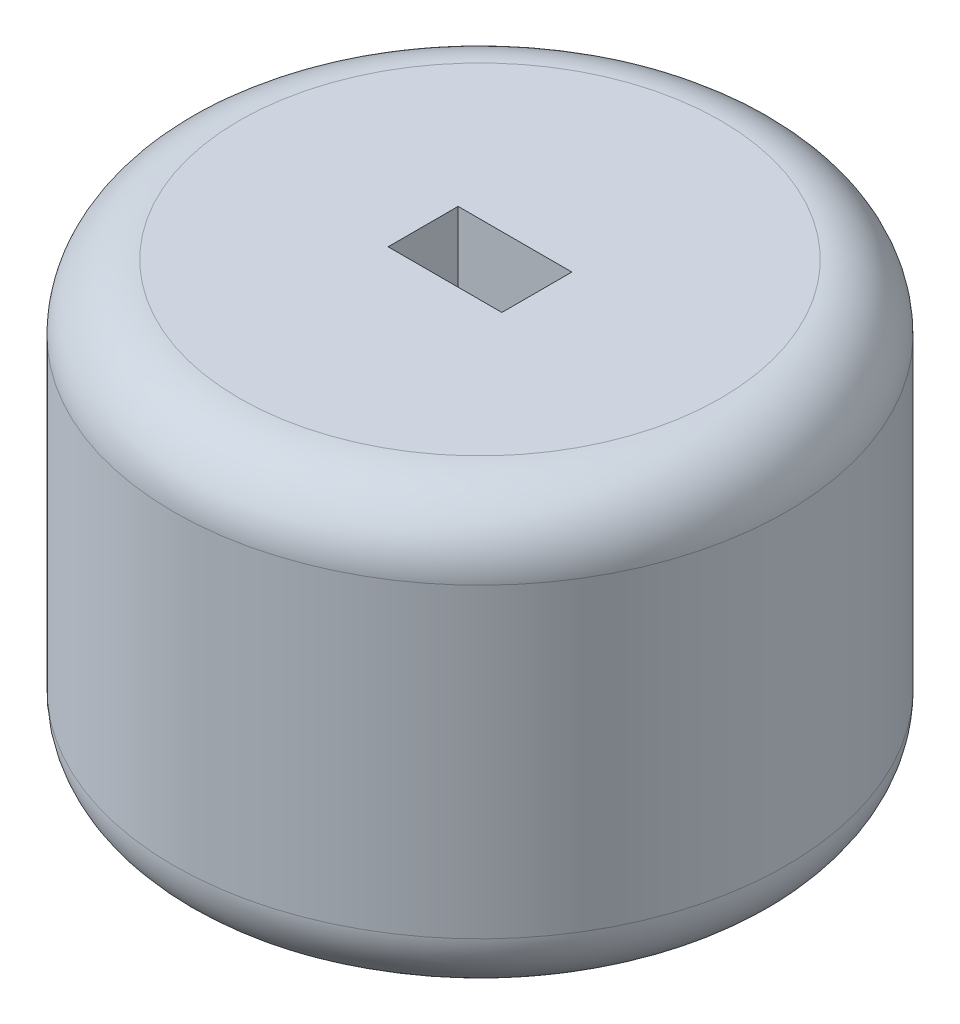
ISO-10303-21;
HEADER;
FILE_DESCRIPTION(('STEP AP214'),'2;1');
FILE_NAME('part.step','',(''),(''),'','','');
FILE_SCHEMA(('AUTOMOTIVE_DESIGN { 1 0 10303 214 1 1 1 1 }'));
ENDSEC;
DATA;
#1=APPLICATION_CONTEXT('core data for automotive mechanical design processes');
#2=APPLICATION_PROTOCOL_DEFINITION('international standard','automotive_design',2000,#1);
#3=PRODUCT_CONTEXT('',#1,'mechanical');
#4=PRODUCT('Part','Part','',(#3));
#5=PRODUCT_RELATED_PRODUCT_CATEGORY('part','',(#4));
#6=PRODUCT_DEFINITION_FORMATION('','',#4);
#7=PRODUCT_DEFINITION_CONTEXT('part definition',#1,'design');
#8=PRODUCT_DEFINITION('design','',#6,#7);
#9=PRODUCT_DEFINITION_SHAPE('','',#8);
#10=(LENGTH_UNIT() NAMED_UNIT(*) SI_UNIT(.MILLI.,.METRE.));
#11=(NAMED_UNIT(*) PLANE_ANGLE_UNIT() SI_UNIT($,.RADIAN.));
#12=(NAMED_UNIT(*) SI_UNIT($,.STERADIAN.) SOLID_ANGLE_UNIT());
#13=UNCERTAINTY_MEASURE_WITH_UNIT(LENGTH_MEASURE(1.E-05),#10,'distance_accuracy_value','');
#14=(GEOMETRIC_REPRESENTATION_CONTEXT(3) GLOBAL_UNCERTAINTY_ASSIGNED_CONTEXT((#13)) GLOBAL_UNIT_ASSIGNED_CONTEXT((#10,
#11,#12)) REPRESENTATION_CONTEXT('',''));
#15=CARTESIAN_POINT('',(0.,0.,0.));
#16=DIRECTION('',(0.,0.,1.));
#17=DIRECTION('',(1.,0.,0.));
#18=AXIS2_PLACEMENT_3D('',#15,#16,#17);
#19=CARTESIAN_POINT('',(0.,20.,0.));
#20=DIRECTION('',(0.,-1.,0.));
#21=DIRECTION('',(0.,0.,-1.));
#22=AXIS2_PLACEMENT_3D('',#19,#20,#21);
#23=CYLINDRICAL_SURFACE('',#22,14.);
#24=CARTESIAN_POINT('',(0.,3.,0.));
#25=DIRECTION('',(0.,1.,0.));
#26=DIRECTION('',(0.,0.,1.));
#27=AXIS2_PLACEMENT_3D('',#24,#25,#26);
#28=CIRCLE('',#27,14.);
#29=CARTESIAN_POINT('',(0.,3.,14.));
#30=VERTEX_POINT('',#29);
#31=EDGE_CURVE('E113',#30,#30,#28,.T.);
#32=ORIENTED_EDGE('',*,*,#31,.T.);
#33=EDGE_LOOP('',(#32));
#34=FACE_BOUND('',#33,.T.);
#35=CARTESIAN_POINT('',(0.,17.,0.));
#36=DIRECTION('',(0.,1.,0.));
#37=DIRECTION('',(0.,0.,1.));
#38=AXIS2_PLACEMENT_3D('',#35,#36,#37);
#39=CIRCLE('',#38,14.);
#40=CARTESIAN_POINT('',(0.,17.,14.));
#41=VERTEX_POINT('',#40);
#42=EDGE_CURVE('E107',#41,#41,#39,.F.);
#43=ORIENTED_EDGE('',*,*,#42,.T.);
#44=EDGE_LOOP('',(#43));
#45=FACE_BOUND('',#44,.T.);
#46=ADVANCED_FACE('F33',(#34,#45),#23,.T.);
#47=CARTESIAN_POINT('',(0.,20.,0.));
#48=DIRECTION('',(0.,1.,0.));
#49=DIRECTION('',(0.,0.,1.));
#50=AXIS2_PLACEMENT_3D('',#47,#48,#49);
#51=PLANE('',#50);
#52=DIRECTION('',(0.,0.,1.));
#53=VECTOR('',#52,1.);
#54=CARTESIAN_POINT('',(2.6,20.,-1.6));
#55=LINE('',#54,#53);
#56=CARTESIAN_POINT('',(2.6,20.,-1.6));
#57=VERTEX_POINT('',#56);
#58=CARTESIAN_POINT('',(2.6,20.,1.6));
#59=VERTEX_POINT('',#58);
#60=EDGE_CURVE('E76',#57,#59,#55,.T.);
#61=ORIENTED_EDGE('',*,*,#60,.T.);
#62=DIRECTION('',(-1.,0.,0.));
#63=VECTOR('',#62,1.);
#64=CARTESIAN_POINT('',(-2.6,20.,1.6));
#65=LINE('',#64,#63);
#66=CARTESIAN_POINT('',(-2.6,20.,1.6));
#67=VERTEX_POINT('',#66);
#68=EDGE_CURVE('E85',#59,#67,#65,.T.);
#69=ORIENTED_EDGE('',*,*,#68,.T.);
#70=DIRECTION('',(0.,0.,-1.));
#71=VECTOR('',#70,1.);
#72=CARTESIAN_POINT('',(-2.6,20.,-1.6));
#73=LINE('',#72,#71);
#74=CARTESIAN_POINT('',(-2.6,20.,-1.6));
#75=VERTEX_POINT('',#74);
#76=EDGE_CURVE('E48',#67,#75,#73,.T.);
#77=ORIENTED_EDGE('',*,*,#76,.T.);
#78=DIRECTION('',(1.,0.,0.));
#79=VECTOR('',#78,1.);
#80=CARTESIAN_POINT('',(-2.6,20.,-1.6));
#81=LINE('',#80,#79);
#82=EDGE_CURVE('E82',#75,#57,#81,.T.);
#83=ORIENTED_EDGE('',*,*,#82,.T.);
#84=EDGE_LOOP('',(#61,#69,#77,#83));
#85=FACE_BOUND('',#84,.T.);
#86=CARTESIAN_POINT('',(0.,20.,0.));
#87=DIRECTION('',(0.,1.,0.));
#88=DIRECTION('',(0.,0.,1.));
#89=AXIS2_PLACEMENT_3D('',#86,#87,#88);
#90=CIRCLE('',#89,11.);
#91=CARTESIAN_POINT('',(0.,20.,11.));
#92=VERTEX_POINT('',#91);
#93=EDGE_CURVE('E11',#92,#92,#90,.T.);
#94=ORIENTED_EDGE('',*,*,#93,.T.);
#95=EDGE_LOOP('',(#94));
#96=FACE_BOUND('',#95,.T.);
#97=ADVANCED_FACE('F89',(#85,#96),#51,.T.);
#98=CARTESIAN_POINT('',(0.,0.,0.));
#99=DIRECTION('',(0.,1.,0.));
#100=DIRECTION('',(0.,0.,1.));
#101=AXIS2_PLACEMENT_3D('',#98,#99,#100);
#102=PLANE('',#101);
#103=DIRECTION('',(-1.,0.,0.));
#104=VECTOR('',#103,1.);
#105=CARTESIAN_POINT('',(-2.6,0.,1.6));
#106=LINE('',#105,#104);
#107=CARTESIAN_POINT('',(2.6,0.,1.6));
#108=VERTEX_POINT('',#107);
#109=CARTESIAN_POINT('',(-2.6,0.,1.6));
#110=VERTEX_POINT('',#109);
#111=EDGE_CURVE('E101',#108,#110,#106,.T.);
#112=ORIENTED_EDGE('',*,*,#111,.F.);
#113=DIRECTION('',(0.,0.,1.));
#114=VECTOR('',#113,1.);
#115=CARTESIAN_POINT('',(2.6,0.,-1.6));
#116=LINE('',#115,#114);
#117=CARTESIAN_POINT('',(2.6,0.,-1.6));
#118=VERTEX_POINT('',#117);
#119=EDGE_CURVE('E56',#118,#108,#116,.T.);
#120=ORIENTED_EDGE('',*,*,#119,.F.);
#121=DIRECTION('',(1.,0.,0.));
#122=VECTOR('',#121,1.);
#123=CARTESIAN_POINT('',(-2.6,0.,-1.6));
#124=LINE('',#123,#122);
#125=CARTESIAN_POINT('',(-2.6,0.,-1.6));
#126=VERTEX_POINT('',#125);
#127=EDGE_CURVE('E92',#126,#118,#124,.T.);
#128=ORIENTED_EDGE('',*,*,#127,.F.);
#129=DIRECTION('',(0.,0.,-1.));
#130=VECTOR('',#129,1.);
#131=CARTESIAN_POINT('',(-2.6,0.,-1.6));
#132=LINE('',#131,#130);
#133=EDGE_CURVE('E95',#110,#126,#132,.T.);
#134=ORIENTED_EDGE('',*,*,#133,.F.);
#135=EDGE_LOOP('',(#112,#120,#128,#134));
#136=FACE_BOUND('',#135,.T.);
#137=CARTESIAN_POINT('',(0.,0.,0.));
#138=DIRECTION('',(0.,1.,0.));
#139=DIRECTION('',(0.,0.,1.));
#140=AXIS2_PLACEMENT_3D('',#137,#138,#139);
#141=CIRCLE('',#140,11.);
#142=CARTESIAN_POINT('',(0.,0.,11.));
#143=VERTEX_POINT('',#142);
#144=EDGE_CURVE('E41',#143,#143,#141,.F.);
#145=ORIENTED_EDGE('',*,*,#144,.T.);
#146=EDGE_LOOP('',(#145));
#147=FACE_BOUND('',#146,.T.);
#148=ADVANCED_FACE('F118',(#136,#147),#102,.F.);
#149=CARTESIAN_POINT('',(0.,3.,0.));
#150=DIRECTION('',(0.,1.,0.));
#151=DIRECTION('',(0.,0.,1.));
#152=AXIS2_PLACEMENT_3D('',#149,#150,#151);
#153=TOROIDAL_SURFACE('',#152,11.,3.);
#154=ORIENTED_EDGE('',*,*,#144,.F.);
#155=EDGE_LOOP('',(#154));
#156=FACE_BOUND('',#155,.T.);
#157=ORIENTED_EDGE('',*,*,#31,.F.);
#158=EDGE_LOOP('',(#157));
#159=FACE_BOUND('',#158,.T.);
#160=ADVANCED_FACE('F120',(#156,#159),#153,.T.);
#161=CARTESIAN_POINT('',(0.,17.,0.));
#162=DIRECTION('',(0.,1.,0.));
#163=DIRECTION('',(0.,0.,1.));
#164=AXIS2_PLACEMENT_3D('',#161,#162,#163);
#165=TOROIDAL_SURFACE('',#164,11.,3.);
#166=ORIENTED_EDGE('',*,*,#42,.F.);
#167=EDGE_LOOP('',(#166));
#168=FACE_BOUND('',#167,.T.);
#169=ORIENTED_EDGE('',*,*,#93,.F.);
#170=EDGE_LOOP('',(#169));
#171=FACE_BOUND('',#170,.T.);
#172=ADVANCED_FACE('F35',(#168,#171),#165,.T.);
#173=CARTESIAN_POINT('',(2.6,20.,-1.6));
#174=DIRECTION('',(1.,0.,0.));
#175=DIRECTION('',(0.,0.,-1.));
#176=AXIS2_PLACEMENT_3D('',#173,#174,#175);
#177=PLANE('',#176);
#178=ORIENTED_EDGE('',*,*,#119,.T.);
#179=DIRECTION('',(0.,-1.,0.));
#180=VECTOR('',#179,1.);
#181=CARTESIAN_POINT('',(2.6,20.,1.6));
#182=LINE('',#181,#180);
#183=EDGE_CURVE('E72',#59,#108,#182,.T.);
#184=ORIENTED_EDGE('',*,*,#183,.F.);
#185=ORIENTED_EDGE('',*,*,#60,.F.);
#186=DIRECTION('',(0.,-1.,0.));
#187=VECTOR('',#186,1.);
#188=CARTESIAN_POINT('',(2.6,20.,-1.6));
#189=LINE('',#188,#187);
#190=EDGE_CURVE('E105',#57,#118,#189,.T.);
#191=ORIENTED_EDGE('',*,*,#190,.T.);
#192=EDGE_LOOP('',(#178,#184,#185,#191));
#193=FACE_BOUND('',#192,.T.);
#194=ADVANCED_FACE('F74',(#193),#177,.F.);
#195=CARTESIAN_POINT('',(-2.6,20.,-1.6));
#196=DIRECTION('',(0.,0.,-1.));
#197=DIRECTION('',(-1.,0.,0.));
#198=AXIS2_PLACEMENT_3D('',#195,#196,#197);
#199=PLANE('',#198);
#200=ORIENTED_EDGE('',*,*,#127,.T.);
#201=ORIENTED_EDGE('',*,*,#190,.F.);
#202=ORIENTED_EDGE('',*,*,#82,.F.);
#203=DIRECTION('',(0.,-1.,0.));
#204=VECTOR('',#203,1.);
#205=CARTESIAN_POINT('',(-2.6,20.,-1.6));
#206=LINE('',#205,#204);
#207=EDGE_CURVE('E108',#75,#126,#206,.T.);
#208=ORIENTED_EDGE('',*,*,#207,.T.);
#209=EDGE_LOOP('',(#200,#201,#202,#208));
#210=FACE_BOUND('',#209,.T.);
#211=ADVANCED_FACE('F143',(#210),#199,.F.);
#212=CARTESIAN_POINT('',(-2.6,20.,-1.6));
#213=DIRECTION('',(-1.,0.,0.));
#214=DIRECTION('',(0.,0.,1.));
#215=AXIS2_PLACEMENT_3D('',#212,#213,#214);
#216=PLANE('',#215);
#217=ORIENTED_EDGE('',*,*,#133,.T.);
#218=ORIENTED_EDGE('',*,*,#207,.F.);
#219=ORIENTED_EDGE('',*,*,#76,.F.);
#220=DIRECTION('',(0.,-1.,0.));
#221=VECTOR('',#220,1.);
#222=CARTESIAN_POINT('',(-2.6,20.,1.6));
#223=LINE('',#222,#221);
#224=EDGE_CURVE('E81',#67,#110,#223,.T.);
#225=ORIENTED_EDGE('',*,*,#224,.T.);
#226=EDGE_LOOP('',(#217,#218,#219,#225));
#227=FACE_BOUND('',#226,.T.);
#228=ADVANCED_FACE('F146',(#227),#216,.F.);
#229=CARTESIAN_POINT('',(-2.6,20.,1.6));
#230=DIRECTION('',(0.,0.,1.));
#231=DIRECTION('',(1.,0.,0.));
#232=AXIS2_PLACEMENT_3D('',#229,#230,#231);
#233=PLANE('',#232);
#234=ORIENTED_EDGE('',*,*,#111,.T.);
#235=ORIENTED_EDGE('',*,*,#224,.F.);
#236=ORIENTED_EDGE('',*,*,#68,.F.);
#237=ORIENTED_EDGE('',*,*,#183,.T.);
#238=EDGE_LOOP('',(#234,#235,#236,#237));
#239=FACE_BOUND('',#238,.T.);
#240=ADVANCED_FACE('F86',(#239),#233,.F.);
#241=CLOSED_SHELL('',(#46,#97,#148,#160,#172,#194,#211,#228,#240));
#242=MANIFOLD_SOLID_BREP('B2',#241);
#243=ADVANCED_BREP_SHAPE_REPRESENTATION('',(#18,#242),#14);
#244=SHAPE_DEFINITION_REPRESENTATION(#9,#243);
ENDSEC;
END-ISO-10303-21;
